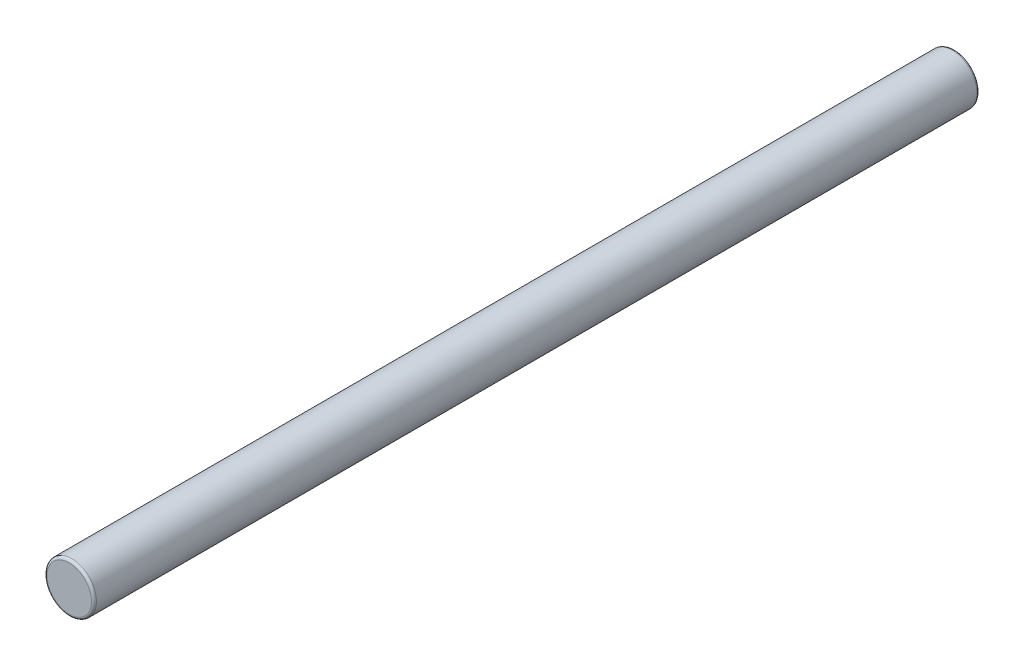
ISO-10303-21;
HEADER;
FILE_DESCRIPTION(('STEP AP214'),'2;1');
FILE_NAME('part.step','',(''),(''),'','','');
FILE_SCHEMA(('AUTOMOTIVE_DESIGN { 1 0 10303 214 1 1 1 1 }'));
ENDSEC;
DATA;
#1=APPLICATION_CONTEXT('core data for automotive mechanical design processes');
#2=APPLICATION_PROTOCOL_DEFINITION('international standard','automotive_design',2000,#1);
#3=PRODUCT_CONTEXT('',#1,'mechanical');
#4=PRODUCT('Part','Part','',(#3));
#5=PRODUCT_RELATED_PRODUCT_CATEGORY('part','',(#4));
#6=PRODUCT_DEFINITION_FORMATION('','',#4);
#7=PRODUCT_DEFINITION_CONTEXT('part definition',#1,'design');
#8=PRODUCT_DEFINITION('design','',#6,#7);
#9=PRODUCT_DEFINITION_SHAPE('','',#8);
#10=(LENGTH_UNIT() NAMED_UNIT(*) SI_UNIT(.MILLI.,.METRE.));
#11=(NAMED_UNIT(*) PLANE_ANGLE_UNIT() SI_UNIT($,.RADIAN.));
#12=(NAMED_UNIT(*) SI_UNIT($,.STERADIAN.) SOLID_ANGLE_UNIT());
#13=UNCERTAINTY_MEASURE_WITH_UNIT(LENGTH_MEASURE(1.E-05),#10,'distance_accuracy_value','');
#14=(GEOMETRIC_REPRESENTATION_CONTEXT(3) GLOBAL_UNCERTAINTY_ASSIGNED_CONTEXT((#13)) GLOBAL_UNIT_ASSIGNED_CONTEXT((#10,
#11,#12)) REPRESENTATION_CONTEXT('',''));
#15=CARTESIAN_POINT('',(0.,0.,0.));
#16=DIRECTION('',(0.,0.,1.));
#17=DIRECTION('',(1.,0.,0.));
#18=AXIS2_PLACEMENT_3D('',#15,#16,#17);
#19=CARTESIAN_POINT('',(0.,0.,8.95));
#20=DIRECTION('',(0.,0.,-1.));
#21=DIRECTION('',(-1.,0.,0.));
#22=AXIS2_PLACEMENT_3D('',#19,#20,#21);
#23=CYLINDRICAL_SURFACE('',#22,0.5);
#24=CARTESIAN_POINT('',(0.,0.,-8.9));
#25=DIRECTION('',(0.,0.,1.));
#26=DIRECTION('',(1.,0.,0.));
#27=AXIS2_PLACEMENT_3D('',#24,#25,#26);
#28=CIRCLE('',#27,0.5);
#29=CARTESIAN_POINT('',(0.5,0.,-8.9));
#30=VERTEX_POINT('',#29);
#31=EDGE_CURVE('E42',#30,#30,#28,.T.);
#32=ORIENTED_EDGE('',*,*,#31,.T.);
#33=EDGE_LOOP('',(#32));
#34=FACE_BOUND('',#33,.T.);
#35=CARTESIAN_POINT('',(0.,0.,8.9));
#36=DIRECTION('',(0.,0.,1.));
#37=DIRECTION('',(1.,0.,0.));
#38=AXIS2_PLACEMENT_3D('',#35,#36,#37);
#39=CIRCLE('',#38,0.5);
#40=CARTESIAN_POINT('',(0.5,0.,8.9));
#41=VERTEX_POINT('',#40);
#42=EDGE_CURVE('E46',#41,#41,#39,.F.);
#43=ORIENTED_EDGE('',*,*,#42,.T.);
#44=EDGE_LOOP('',(#43));
#45=FACE_BOUND('',#44,.T.);
#46=ADVANCED_FACE('F31',(#34,#45),#23,.T.);
#47=CARTESIAN_POINT('',(0.,0.,8.95));
#48=DIRECTION('',(0.,0.,1.));
#49=DIRECTION('',(1.,0.,0.));
#50=AXIS2_PLACEMENT_3D('',#47,#48,#49);
#51=PLANE('',#50);
#52=CARTESIAN_POINT('',(0.,0.,8.95));
#53=DIRECTION('',(0.,0.,1.));
#54=DIRECTION('',(1.,0.,0.));
#55=AXIS2_PLACEMENT_3D('',#52,#53,#54);
#56=CIRCLE('',#55,0.45);
#57=CARTESIAN_POINT('',(0.45,0.,8.95));
#58=VERTEX_POINT('',#57);
#59=EDGE_CURVE('E10',#58,#58,#56,.T.);
#60=ORIENTED_EDGE('',*,*,#59,.T.);
#61=EDGE_LOOP('',(#60));
#62=FACE_BOUND('',#61,.T.);
#63=ADVANCED_FACE('F62',(#62),#51,.T.);
#64=CARTESIAN_POINT('',(0.,0.,-8.95));
#65=DIRECTION('',(0.,0.,1.));
#66=DIRECTION('',(1.,0.,0.));
#67=AXIS2_PLACEMENT_3D('',#64,#65,#66);
#68=PLANE('',#67);
#69=CARTESIAN_POINT('',(0.,0.,-8.95));
#70=DIRECTION('',(0.,0.,1.));
#71=DIRECTION('',(1.,0.,0.));
#72=AXIS2_PLACEMENT_3D('',#69,#70,#71);
#73=CIRCLE('',#72,0.45);
#74=CARTESIAN_POINT('',(0.45,0.,-8.95));
#75=VERTEX_POINT('',#74);
#76=EDGE_CURVE('E38',#75,#75,#73,.F.);
#77=ORIENTED_EDGE('',*,*,#76,.T.);
#78=EDGE_LOOP('',(#77));
#79=FACE_BOUND('',#78,.T.);
#80=ADVANCED_FACE('F59',(#79),#68,.F.);
#81=CARTESIAN_POINT('',(0.,0.,-8.9));
#82=DIRECTION('',(0.,0.,1.));
#83=DIRECTION('',(1.,0.,0.));
#84=AXIS2_PLACEMENT_3D('',#81,#82,#83);
#85=TOROIDAL_SURFACE('',#84,0.45,0.05);
#86=ORIENTED_EDGE('',*,*,#76,.F.);
#87=EDGE_LOOP('',(#86));
#88=FACE_BOUND('',#87,.T.);
#89=ORIENTED_EDGE('',*,*,#31,.F.);
#90=EDGE_LOOP('',(#89));
#91=FACE_BOUND('',#90,.T.);
#92=ADVANCED_FACE('F55',(#88,#91),#85,.T.);
#93=CARTESIAN_POINT('',(0.,0.,8.9));
#94=DIRECTION('',(0.,0.,1.));
#95=DIRECTION('',(1.,0.,0.));
#96=AXIS2_PLACEMENT_3D('',#93,#94,#95);
#97=TOROIDAL_SURFACE('',#96,0.45,0.05);
#98=ORIENTED_EDGE('',*,*,#42,.F.);
#99=EDGE_LOOP('',(#98));
#100=FACE_BOUND('',#99,.T.);
#101=ORIENTED_EDGE('',*,*,#59,.F.);
#102=EDGE_LOOP('',(#101));
#103=FACE_BOUND('',#102,.T.);
#104=ADVANCED_FACE('F33',(#100,#103),#97,.T.);
#105=CLOSED_SHELL('',(#46,#63,#80,#92,#104));
#106=MANIFOLD_SOLID_BREP('B2',#105);
#107=ADVANCED_BREP_SHAPE_REPRESENTATION('',(#18,#106),#14);
#108=SHAPE_DEFINITION_REPRESENTATION(#9,#107);
ENDSEC;
END-ISO-10303-21;
